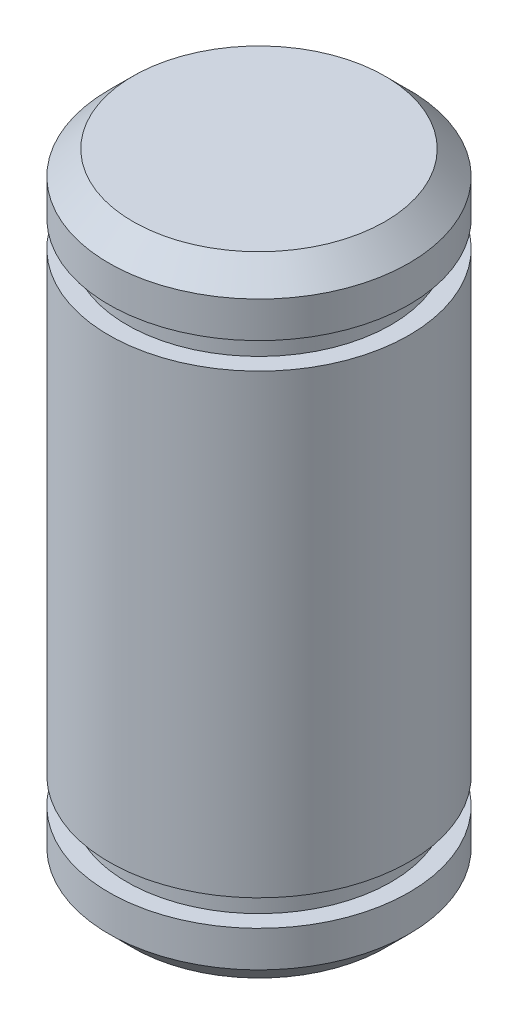
ISO-10303-21;
HEADER;
FILE_DESCRIPTION(('STEP AP214'),'2;1');
FILE_NAME('part.step','',(''),(''),'','','');
FILE_SCHEMA(('AUTOMOTIVE_DESIGN { 1 0 10303 214 1 1 1 1 }'));
ENDSEC;
DATA;
#1=APPLICATION_CONTEXT('core data for automotive mechanical design processes');
#2=APPLICATION_PROTOCOL_DEFINITION('international standard','automotive_design',2000,#1);
#3=PRODUCT_CONTEXT('',#1,'mechanical');
#4=PRODUCT('Part','Part','',(#3));
#5=PRODUCT_RELATED_PRODUCT_CATEGORY('part','',(#4));
#6=PRODUCT_DEFINITION_FORMATION('','',#4);
#7=PRODUCT_DEFINITION_CONTEXT('part definition',#1,'design');
#8=PRODUCT_DEFINITION('design','',#6,#7);
#9=PRODUCT_DEFINITION_SHAPE('','',#8);
#10=(LENGTH_UNIT() NAMED_UNIT(*) SI_UNIT(.MILLI.,.METRE.));
#11=(NAMED_UNIT(*) PLANE_ANGLE_UNIT() SI_UNIT($,.RADIAN.));
#12=(NAMED_UNIT(*) SI_UNIT($,.STERADIAN.) SOLID_ANGLE_UNIT());
#13=UNCERTAINTY_MEASURE_WITH_UNIT(LENGTH_MEASURE(1.E-05),#10,'distance_accuracy_value','');
#14=(GEOMETRIC_REPRESENTATION_CONTEXT(3) GLOBAL_UNCERTAINTY_ASSIGNED_CONTEXT((#13)) GLOBAL_UNIT_ASSIGNED_CONTEXT((#10,
#11,#12)) REPRESENTATION_CONTEXT('',''));
#15=CARTESIAN_POINT('',(0.,0.,0.));
#16=DIRECTION('',(0.,0.,1.));
#17=DIRECTION('',(1.,0.,0.));
#18=AXIS2_PLACEMENT_3D('',#15,#16,#17);
#19=CARTESIAN_POINT('',(0.,-6.6548,0.));
#20=DIRECTION('',(0.,1.,0.));
#21=DIRECTION('',(-1.,0.,0.));
#22=AXIS2_PLACEMENT_3D('',#19,#20,#21);
#23=PLANE('',#22);
#24=CARTESIAN_POINT('',(0.,-6.6548,0.));
#25=DIRECTION('',(0.,1.,0.));
#26=DIRECTION('',(-1.,0.,0.));
#27=AXIS2_PLACEMENT_3D('',#24,#25,#26);
#28=CIRCLE('',#27,2.667);
#29=CARTESIAN_POINT('',(-2.667,-6.6548,0.));
#30=VERTEX_POINT('',#29);
#31=EDGE_CURVE('E46',#30,#30,#28,.F.);
#32=ORIENTED_EDGE('',*,*,#31,.T.);
#33=EDGE_LOOP('',(#32));
#34=FACE_BOUND('',#33,.T.);
#35=ADVANCED_FACE('F31',(#34),#23,.F.);
#36=CARTESIAN_POINT('',(0.,6.6548,0.));
#37=DIRECTION('',(0.,-1.,0.));
#38=DIRECTION('',(1.,0.,0.));
#39=AXIS2_PLACEMENT_3D('',#36,#37,#38);
#40=CYLINDRICAL_SURFACE('',#39,3.175);
#41=CARTESIAN_POINT('',(0.,-6.1468,0.));
#42=DIRECTION('',(0.,1.,0.));
#43=DIRECTION('',(-1.,0.,0.));
#44=AXIS2_PLACEMENT_3D('',#41,#42,#43);
#45=CIRCLE('',#44,3.175);
#46=CARTESIAN_POINT('',(-3.175,-6.1468,0.));
#47=VERTEX_POINT('',#46);
#48=EDGE_CURVE('E42',#47,#47,#45,.T.);
#49=ORIENTED_EDGE('',*,*,#48,.T.);
#50=EDGE_LOOP('',(#49));
#51=FACE_BOUND('',#50,.T.);
#52=CARTESIAN_POINT('',(0.,-5.3848,0.));
#53=DIRECTION('',(0.,-1.,0.));
#54=DIRECTION('',(1.,0.,0.));
#55=AXIS2_PLACEMENT_3D('',#52,#53,#54);
#56=CIRCLE('',#55,3.175);
#57=CARTESIAN_POINT('',(3.17500000000001,-5.3848,0.));
#58=VERTEX_POINT('',#57);
#59=EDGE_CURVE('E51',#58,#58,#56,.T.);
#60=ORIENTED_EDGE('',*,*,#59,.T.);
#61=EDGE_LOOP('',(#60));
#62=FACE_BOUND('',#61,.T.);
#63=ADVANCED_FACE('F92',(#51,#62),#40,.T.);
#64=CARTESIAN_POINT('',(-3.175,-5.3848,0.));
#65=DIRECTION('',(0.,-1.,0.));
#66=DIRECTION('',(1.,0.,0.));
#67=AXIS2_PLACEMENT_3D('',#64,#65,#66);
#68=PLANE('',#67);
#69=ORIENTED_EDGE('',*,*,#59,.F.);
#70=EDGE_LOOP('',(#69));
#71=FACE_BOUND('',#70,.T.);
#72=CARTESIAN_POINT('',(0.,-5.3848,0.));
#73=DIRECTION('',(0.,-1.,0.));
#74=DIRECTION('',(1.,0.,0.));
#75=AXIS2_PLACEMENT_3D('',#72,#73,#74);
#76=CIRCLE('',#75,2.794);
#77=CARTESIAN_POINT('',(2.79400000000001,-5.3848,0.));
#78=VERTEX_POINT('',#77);
#79=EDGE_CURVE('E54',#78,#78,#76,.T.);
#80=ORIENTED_EDGE('',*,*,#79,.T.);
#81=EDGE_LOOP('',(#80));
#82=FACE_BOUND('',#81,.T.);
#83=ADVANCED_FACE('F98',(#71,#82),#68,.F.);
#84=CARTESIAN_POINT('',(0.,6.6548,0.));
#85=DIRECTION('',(0.,-1.,0.));
#86=DIRECTION('',(1.,0.,0.));
#87=AXIS2_PLACEMENT_3D('',#84,#85,#86);
#88=CYLINDRICAL_SURFACE('',#87,2.794);
#89=ORIENTED_EDGE('',*,*,#79,.F.);
#90=EDGE_LOOP('',(#89));
#91=FACE_BOUND('',#90,.T.);
#92=CARTESIAN_POINT('',(0.,-4.826,0.));
#93=DIRECTION('',(0.,-1.,0.));
#94=DIRECTION('',(1.,0.,0.));
#95=AXIS2_PLACEMENT_3D('',#92,#93,#94);
#96=CIRCLE('',#95,2.794);
#97=CARTESIAN_POINT('',(2.79400000000001,-4.826,0.));
#98=VERTEX_POINT('',#97);
#99=EDGE_CURVE('E57',#98,#98,#96,.T.);
#100=ORIENTED_EDGE('',*,*,#99,.T.);
#101=EDGE_LOOP('',(#100));
#102=FACE_BOUND('',#101,.T.);
#103=ADVANCED_FACE('F116',(#91,#102),#88,.T.);
#104=CARTESIAN_POINT('',(-3.175,-4.826,0.));
#105=DIRECTION('',(0.,1.,0.));
#106=DIRECTION('',(-1.,0.,0.));
#107=AXIS2_PLACEMENT_3D('',#104,#105,#106);
#108=PLANE('',#107);
#109=ORIENTED_EDGE('',*,*,#99,.F.);
#110=EDGE_LOOP('',(#109));
#111=FACE_BOUND('',#110,.T.);
#112=CARTESIAN_POINT('',(0.,-4.826,0.));
#113=DIRECTION('',(0.,-1.,0.));
#114=DIRECTION('',(1.,0.,0.));
#115=AXIS2_PLACEMENT_3D('',#112,#113,#114);
#116=CIRCLE('',#115,3.175);
#117=CARTESIAN_POINT('',(3.17500000000001,-4.826,0.));
#118=VERTEX_POINT('',#117);
#119=EDGE_CURVE('E60',#118,#118,#116,.T.);
#120=ORIENTED_EDGE('',*,*,#119,.T.);
#121=EDGE_LOOP('',(#120));
#122=FACE_BOUND('',#121,.T.);
#123=ADVANCED_FACE('F121',(#111,#122),#108,.F.);
#124=CARTESIAN_POINT('',(0.,6.6548,0.));
#125=DIRECTION('',(0.,-1.,0.));
#126=DIRECTION('',(1.,0.,0.));
#127=AXIS2_PLACEMENT_3D('',#124,#125,#126);
#128=CYLINDRICAL_SURFACE('',#127,3.175);
#129=ORIENTED_EDGE('',*,*,#119,.F.);
#130=EDGE_LOOP('',(#129));
#131=FACE_BOUND('',#130,.T.);
#132=CARTESIAN_POINT('',(0.,4.826,0.));
#133=DIRECTION('',(0.,-1.,0.));
#134=DIRECTION('',(1.,0.,0.));
#135=AXIS2_PLACEMENT_3D('',#132,#133,#134);
#136=CIRCLE('',#135,3.175);
#137=CARTESIAN_POINT('',(3.175,4.826,0.));
#138=VERTEX_POINT('',#137);
#139=EDGE_CURVE('E63',#138,#138,#136,.T.);
#140=ORIENTED_EDGE('',*,*,#139,.T.);
#141=EDGE_LOOP('',(#140));
#142=FACE_BOUND('',#141,.T.);
#143=ADVANCED_FACE('F127',(#131,#142),#128,.T.);
#144=CARTESIAN_POINT('',(-3.175,4.826,0.));
#145=DIRECTION('',(0.,-1.,0.));
#146=DIRECTION('',(1.,0.,0.));
#147=AXIS2_PLACEMENT_3D('',#144,#145,#146);
#148=PLANE('',#147);
#149=ORIENTED_EDGE('',*,*,#139,.F.);
#150=EDGE_LOOP('',(#149));
#151=FACE_BOUND('',#150,.T.);
#152=CARTESIAN_POINT('',(0.,4.826,0.));
#153=DIRECTION('',(0.,-1.,0.));
#154=DIRECTION('',(1.,0.,0.));
#155=AXIS2_PLACEMENT_3D('',#152,#153,#154);
#156=CIRCLE('',#155,2.794);
#157=CARTESIAN_POINT('',(2.794,4.826,0.));
#158=VERTEX_POINT('',#157);
#159=EDGE_CURVE('E66',#158,#158,#156,.T.);
#160=ORIENTED_EDGE('',*,*,#159,.T.);
#161=EDGE_LOOP('',(#160));
#162=FACE_BOUND('',#161,.T.);
#163=ADVANCED_FACE('F133',(#151,#162),#148,.F.);
#164=CARTESIAN_POINT('',(0.,6.6548,0.));
#165=DIRECTION('',(0.,-1.,0.));
#166=DIRECTION('',(1.,0.,0.));
#167=AXIS2_PLACEMENT_3D('',#164,#165,#166);
#168=CYLINDRICAL_SURFACE('',#167,2.794);
#169=ORIENTED_EDGE('',*,*,#159,.F.);
#170=EDGE_LOOP('',(#169));
#171=FACE_BOUND('',#170,.T.);
#172=CARTESIAN_POINT('',(0.,5.3848,0.));
#173=DIRECTION('',(0.,-1.,0.));
#174=DIRECTION('',(1.,0.,0.));
#175=AXIS2_PLACEMENT_3D('',#172,#173,#174);
#176=CIRCLE('',#175,2.794);
#177=CARTESIAN_POINT('',(2.794,5.3848,0.));
#178=VERTEX_POINT('',#177);
#179=EDGE_CURVE('E69',#178,#178,#176,.T.);
#180=ORIENTED_EDGE('',*,*,#179,.T.);
#181=EDGE_LOOP('',(#180));
#182=FACE_BOUND('',#181,.T.);
#183=ADVANCED_FACE('F88',(#171,#182),#168,.T.);
#184=CARTESIAN_POINT('',(-3.175,5.3848,0.));
#185=DIRECTION('',(0.,1.,0.));
#186=DIRECTION('',(-1.,0.,0.));
#187=AXIS2_PLACEMENT_3D('',#184,#185,#186);
#188=PLANE('',#187);
#189=ORIENTED_EDGE('',*,*,#179,.F.);
#190=EDGE_LOOP('',(#189));
#191=FACE_BOUND('',#190,.T.);
#192=CARTESIAN_POINT('',(0.,5.3848,0.));
#193=DIRECTION('',(0.,-1.,0.));
#194=DIRECTION('',(1.,0.,0.));
#195=AXIS2_PLACEMENT_3D('',#192,#193,#194);
#196=CIRCLE('',#195,3.175);
#197=CARTESIAN_POINT('',(3.175,5.3848,0.));
#198=VERTEX_POINT('',#197);
#199=EDGE_CURVE('E72',#198,#198,#196,.T.);
#200=ORIENTED_EDGE('',*,*,#199,.T.);
#201=EDGE_LOOP('',(#200));
#202=FACE_BOUND('',#201,.T.);
#203=ADVANCED_FACE('F76',(#191,#202),#188,.F.);
#204=CARTESIAN_POINT('',(0.,6.6548,0.));
#205=DIRECTION('',(0.,-1.,0.));
#206=DIRECTION('',(1.,0.,0.));
#207=AXIS2_PLACEMENT_3D('',#204,#205,#206);
#208=CYLINDRICAL_SURFACE('',#207,3.175);
#209=CARTESIAN_POINT('',(0.,6.1468,0.));
#210=DIRECTION('',(0.,-1.,0.));
#211=DIRECTION('',(1.,0.,0.));
#212=AXIS2_PLACEMENT_3D('',#209,#210,#211);
#213=CIRCLE('',#212,3.175);
#214=CARTESIAN_POINT('',(3.175,6.1468,0.));
#215=VERTEX_POINT('',#214);
#216=EDGE_CURVE('E38',#215,#215,#213,.T.);
#217=ORIENTED_EDGE('',*,*,#216,.T.);
#218=EDGE_LOOP('',(#217));
#219=FACE_BOUND('',#218,.T.);
#220=ORIENTED_EDGE('',*,*,#199,.F.);
#221=EDGE_LOOP('',(#220));
#222=FACE_BOUND('',#221,.T.);
#223=ADVANCED_FACE('F78',(#219,#222),#208,.T.);
#224=CARTESIAN_POINT('',(0.,6.6548,0.));
#225=DIRECTION('',(0.,-1.,0.));
#226=DIRECTION('',(1.,0.,0.));
#227=AXIS2_PLACEMENT_3D('',#224,#225,#226);
#228=PLANE('',#227);
#229=CARTESIAN_POINT('',(0.,6.6548,0.));
#230=DIRECTION('',(0.,-1.,0.));
#231=DIRECTION('',(1.,0.,0.));
#232=AXIS2_PLACEMENT_3D('',#229,#230,#231);
#233=CIRCLE('',#232,2.667);
#234=CARTESIAN_POINT('',(2.667,6.6548,0.));
#235=VERTEX_POINT('',#234);
#236=EDGE_CURVE('E10',#235,#235,#233,.F.);
#237=ORIENTED_EDGE('',*,*,#236,.T.);
#238=EDGE_LOOP('',(#237));
#239=FACE_BOUND('',#238,.T.);
#240=ADVANCED_FACE('F80',(#239),#228,.F.);
#241=CARTESIAN_POINT('',(0.,-6.6548,0.));
#242=DIRECTION('',(0.,1.,0.));
#243=DIRECTION('',(-1.,0.,0.));
#244=AXIS2_PLACEMENT_3D('',#241,#242,#243);
#245=CONICAL_SURFACE('',#244,2.667,0.785398163397449);
#246=ORIENTED_EDGE('',*,*,#48,.F.);
#247=EDGE_LOOP('',(#246));
#248=FACE_BOUND('',#247,.T.);
#249=ORIENTED_EDGE('',*,*,#31,.F.);
#250=EDGE_LOOP('',(#249));
#251=FACE_BOUND('',#250,.T.);
#252=ADVANCED_FACE('F86',(#248,#251),#245,.T.);
#253=CARTESIAN_POINT('',(0.,6.1468,0.));
#254=DIRECTION('',(0.,-1.,0.));
#255=DIRECTION('',(1.,0.,0.));
#256=AXIS2_PLACEMENT_3D('',#253,#254,#255);
#257=CONICAL_SURFACE('',#256,3.175,0.78539816339745);
#258=ORIENTED_EDGE('',*,*,#236,.F.);
#259=EDGE_LOOP('',(#258));
#260=FACE_BOUND('',#259,.T.);
#261=ORIENTED_EDGE('',*,*,#216,.F.);
#262=EDGE_LOOP('',(#261));
#263=FACE_BOUND('',#262,.T.);
#264=ADVANCED_FACE('F33',(#260,#263),#257,.T.);
#265=CLOSED_SHELL('',(#35,#63,#83,#103,#123,#143,#163,#183,#203,#223,#240,#252,#264));
#266=MANIFOLD_SOLID_BREP('B2',#265);
#267=ADVANCED_BREP_SHAPE_REPRESENTATION('',(#18,#266),#14);
#268=SHAPE_DEFINITION_REPRESENTATION(#9,#267);
ENDSEC;
END-ISO-10303-21;
